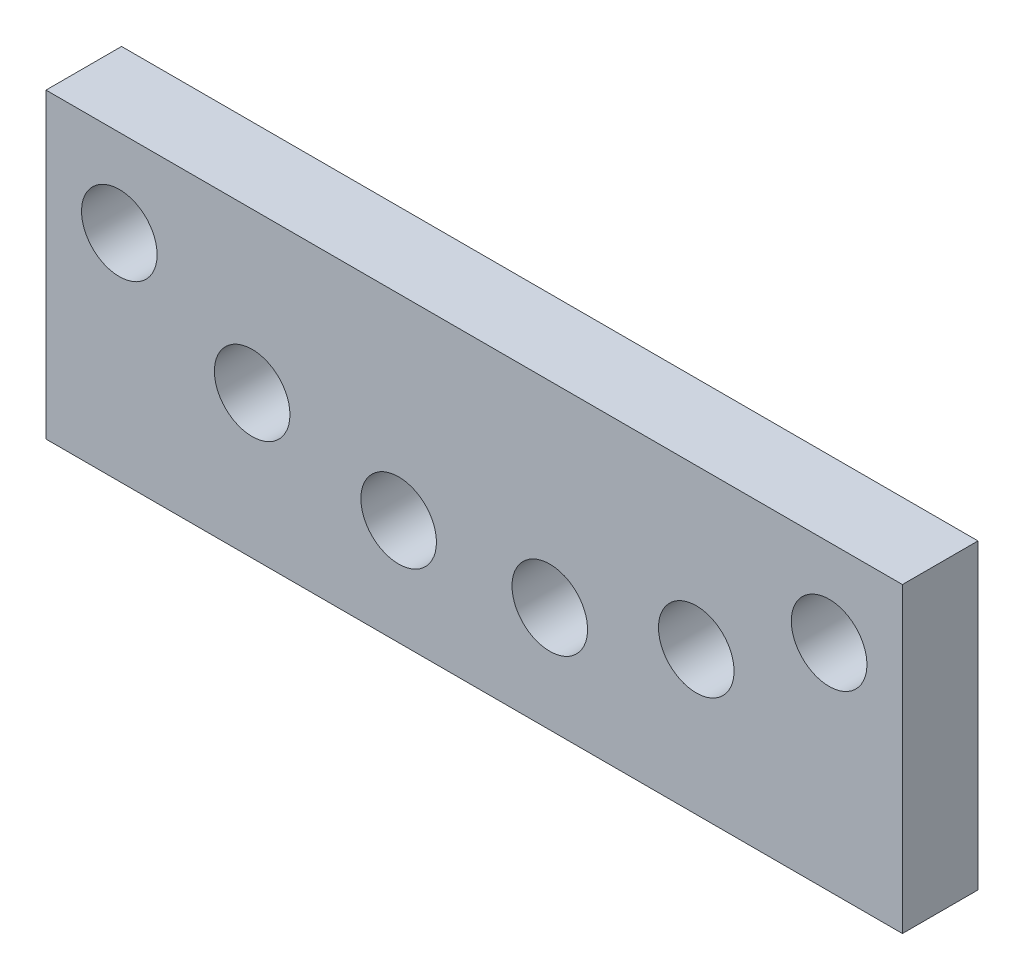
ISO-10303-21;
HEADER;
FILE_DESCRIPTION(('STEP AP214'),'2;1');
FILE_NAME('part.step','',(''),(''),'','','');
FILE_SCHEMA(('AUTOMOTIVE_DESIGN { 1 0 10303 214 1 1 1 1 }'));
ENDSEC;
DATA;
#1=APPLICATION_CONTEXT('core data for automotive mechanical design processes');
#2=APPLICATION_PROTOCOL_DEFINITION('international standard','automotive_design',2000,#1);
#3=PRODUCT_CONTEXT('',#1,'mechanical');
#4=PRODUCT('Part','Part','',(#3));
#5=PRODUCT_RELATED_PRODUCT_CATEGORY('part','',(#4));
#6=PRODUCT_DEFINITION_FORMATION('','',#4);
#7=PRODUCT_DEFINITION_CONTEXT('part definition',#1,'design');
#8=PRODUCT_DEFINITION('design','',#6,#7);
#9=PRODUCT_DEFINITION_SHAPE('','',#8);
#10=(LENGTH_UNIT() NAMED_UNIT(*) SI_UNIT(.MILLI.,.METRE.));
#11=(NAMED_UNIT(*) PLANE_ANGLE_UNIT() SI_UNIT($,.RADIAN.));
#12=(NAMED_UNIT(*) SI_UNIT($,.STERADIAN.) SOLID_ANGLE_UNIT());
#13=UNCERTAINTY_MEASURE_WITH_UNIT(LENGTH_MEASURE(1.E-05),#10,'distance_accuracy_value','');
#14=(GEOMETRIC_REPRESENTATION_CONTEXT(3) GLOBAL_UNCERTAINTY_ASSIGNED_CONTEXT((#13)) GLOBAL_UNIT_ASSIGNED_CONTEXT((#10,
#11,#12)) REPRESENTATION_CONTEXT('',''));
#15=CARTESIAN_POINT('',(0.,0.,0.));
#16=DIRECTION('',(0.,0.,1.));
#17=DIRECTION('',(1.,0.,0.));
#18=AXIS2_PLACEMENT_3D('',#15,#16,#17);
#19=CARTESIAN_POINT('',(85.,-30.,7.5));
#20=DIRECTION('',(0.,1.,0.));
#21=DIRECTION('',(0.,0.,1.));
#22=AXIS2_PLACEMENT_3D('',#19,#20,#21);
#23=PLANE('',#22);
#24=DIRECTION('',(0.,0.,-1.));
#25=VECTOR('',#24,1.);
#26=CARTESIAN_POINT('',(-85.,-30.,7.5));
#27=LINE('',#26,#25);
#28=CARTESIAN_POINT('',(-85.,-30.,7.5));
#29=VERTEX_POINT('',#28);
#30=CARTESIAN_POINT('',(-85.,-30.,-7.5));
#31=VERTEX_POINT('',#30);
#32=EDGE_CURVE('E111',#29,#31,#27,.T.);
#33=ORIENTED_EDGE('',*,*,#32,.T.);
#34=DIRECTION('',(-1.,0.,0.));
#35=VECTOR('',#34,1.);
#36=CARTESIAN_POINT('',(85.,-30.,-7.5));
#37=LINE('',#36,#35);
#38=CARTESIAN_POINT('',(85.,-30.,-7.5));
#39=VERTEX_POINT('',#38);
#40=EDGE_CURVE('E12',#39,#31,#37,.T.);
#41=ORIENTED_EDGE('',*,*,#40,.F.);
#42=DIRECTION('',(0.,0.,-1.));
#43=VECTOR('',#42,1.);
#44=CARTESIAN_POINT('',(85.,-30.,7.5));
#45=LINE('',#44,#43);
#46=CARTESIAN_POINT('',(85.,-30.,7.5));
#47=VERTEX_POINT('',#46);
#48=EDGE_CURVE('E99',#47,#39,#45,.T.);
#49=ORIENTED_EDGE('',*,*,#48,.F.);
#50=DIRECTION('',(-1.,0.,0.));
#51=VECTOR('',#50,1.);
#52=CARTESIAN_POINT('',(85.,-30.,7.5));
#53=LINE('',#52,#51);
#54=EDGE_CURVE('E107',#47,#29,#53,.T.);
#55=ORIENTED_EDGE('',*,*,#54,.T.);
#56=EDGE_LOOP('',(#33,#41,#49,#55));
#57=FACE_BOUND('',#56,.T.);
#58=ADVANCED_FACE('F48',(#57),#23,.F.);
#59=CARTESIAN_POINT('',(85.,-30.,-7.5));
#60=DIRECTION('',(0.,0.,1.));
#61=DIRECTION('',(1.,0.,0.));
#62=AXIS2_PLACEMENT_3D('',#59,#60,#61);
#63=PLANE('',#62);
#64=CARTESIAN_POINT('',(15.,-8.97969273634752,-7.5));
#65=DIRECTION('',(0.,0.,1.));
#66=DIRECTION('',(-1.,0.,0.));
#67=AXIS2_PLACEMENT_3D('',#64,#65,#66);
#68=CIRCLE('',#67,7.49999999999999);
#69=CARTESIAN_POINT('',(7.50000000000001,-8.97969273634752,-7.5));
#70=VERTEX_POINT('',#69);
#71=EDGE_CURVE('E152',#70,#70,#68,.T.);
#72=ORIENTED_EDGE('',*,*,#71,.T.);
#73=EDGE_LOOP('',(#72));
#74=FACE_BOUND('',#73,.T.);
#75=CARTESIAN_POINT('',(44.0779318352571,-1.59905047539634,-7.5));
#76=DIRECTION('',(0.,0.,1.));
#77=DIRECTION('',(-1.,0.,0.));
#78=AXIS2_PLACEMENT_3D('',#75,#76,#77);
#79=CIRCLE('',#78,7.5);
#80=CARTESIAN_POINT('',(36.5779318352571,-1.59905047539634,-7.5));
#81=VERTEX_POINT('',#80);
#82=EDGE_CURVE('E146',#81,#81,#79,.T.);
#83=ORIENTED_EDGE('',*,*,#82,.T.);
#84=EDGE_LOOP('',(#83));
#85=FACE_BOUND('',#84,.T.);
#86=CARTESIAN_POINT('',(-70.4463398229813,12.7085370288941,-7.5));
#87=DIRECTION('',(0.,0.,1.));
#88=DIRECTION('',(1.,0.,0.));
#89=AXIS2_PLACEMENT_3D('',#86,#87,#88);
#90=CIRCLE('',#89,7.5);
#91=CARTESIAN_POINT('',(-62.9463398229813,12.7085370288941,-7.5));
#92=VERTEX_POINT('',#91);
#93=EDGE_CURVE('E140',#92,#92,#90,.T.);
#94=ORIENTED_EDGE('',*,*,#93,.T.);
#95=EDGE_LOOP('',(#94));
#96=FACE_BOUND('',#95,.T.);
#97=CARTESIAN_POINT('',(-44.0779318352571,-1.59905047539634,-7.5));
#98=DIRECTION('',(0.,0.,1.));
#99=DIRECTION('',(1.,0.,0.));
#100=AXIS2_PLACEMENT_3D('',#97,#98,#99);
#101=CIRCLE('',#100,7.5);
#102=CARTESIAN_POINT('',(-36.5779318352571,-1.59905047539634,-7.5));
#103=VERTEX_POINT('',#102);
#104=EDGE_CURVE('E134',#103,#103,#101,.T.);
#105=ORIENTED_EDGE('',*,*,#104,.T.);
#106=EDGE_LOOP('',(#105));
#107=FACE_BOUND('',#106,.T.);
#108=CARTESIAN_POINT('',(-15.,-8.97969273634752,-7.5));
#109=DIRECTION('',(0.,0.,1.));
#110=DIRECTION('',(1.,0.,0.));
#111=AXIS2_PLACEMENT_3D('',#108,#109,#110);
#112=CIRCLE('',#111,7.5);
#113=CARTESIAN_POINT('',(-7.5,-8.97969273634752,-7.5));
#114=VERTEX_POINT('',#113);
#115=EDGE_CURVE('E128',#114,#114,#112,.T.);
#116=ORIENTED_EDGE('',*,*,#115,.T.);
#117=EDGE_LOOP('',(#116));
#118=FACE_BOUND('',#117,.T.);
#119=CARTESIAN_POINT('',(70.4463398229813,12.7085370288941,-7.5));
#120=DIRECTION('',(0.,0.,1.));
#121=DIRECTION('',(-1.,0.,0.));
#122=AXIS2_PLACEMENT_3D('',#119,#120,#121);
#123=CIRCLE('',#122,7.50000000000001);
#124=CARTESIAN_POINT('',(62.9463398229812,12.7085370288941,-7.5));
#125=VERTEX_POINT('',#124);
#126=EDGE_CURVE('E114',#125,#125,#123,.T.);
#127=ORIENTED_EDGE('',*,*,#126,.T.);
#128=EDGE_LOOP('',(#127));
#129=FACE_BOUND('',#128,.T.);
#130=DIRECTION('',(0.,1.,0.));
#131=VECTOR('',#130,1.);
#132=CARTESIAN_POINT('',(-85.,-30.,-7.5));
#133=LINE('',#132,#131);
#134=CARTESIAN_POINT('',(-85.,30.,-7.5));
#135=VERTEX_POINT('',#134);
#136=EDGE_CURVE('E103',#31,#135,#133,.T.);
#137=ORIENTED_EDGE('',*,*,#136,.T.);
#138=DIRECTION('',(-1.,0.,0.));
#139=VECTOR('',#138,1.);
#140=CARTESIAN_POINT('',(85.,30.,-7.5));
#141=LINE('',#140,#139);
#142=CARTESIAN_POINT('',(85.,30.,-7.5));
#143=VERTEX_POINT('',#142);
#144=EDGE_CURVE('E56',#143,#135,#141,.T.);
#145=ORIENTED_EDGE('',*,*,#144,.F.);
#146=DIRECTION('',(0.,1.,0.));
#147=VECTOR('',#146,1.);
#148=CARTESIAN_POINT('',(85.,-30.,-7.5));
#149=LINE('',#148,#147);
#150=EDGE_CURVE('E94',#39,#143,#149,.T.);
#151=ORIENTED_EDGE('',*,*,#150,.F.);
#152=ORIENTED_EDGE('',*,*,#40,.T.);
#153=EDGE_LOOP('',(#137,#145,#151,#152));
#154=FACE_BOUND('',#153,.T.);
#155=ADVANCED_FACE('F102',(#74,#85,#96,#107,#118,#129,#154),#63,.F.);
#156=CARTESIAN_POINT('',(85.,30.,7.5));
#157=DIRECTION('',(0.,-1.,0.));
#158=DIRECTION('',(0.,0.,-1.));
#159=AXIS2_PLACEMENT_3D('',#156,#157,#158);
#160=PLANE('',#159);
#161=DIRECTION('',(0.,0.,1.));
#162=VECTOR('',#161,1.);
#163=CARTESIAN_POINT('',(-85.,30.,7.5));
#164=LINE('',#163,#162);
#165=CARTESIAN_POINT('',(-85.,30.,7.5));
#166=VERTEX_POINT('',#165);
#167=EDGE_CURVE('E81',#135,#166,#164,.T.);
#168=ORIENTED_EDGE('',*,*,#167,.T.);
#169=DIRECTION('',(-1.,0.,0.));
#170=VECTOR('',#169,1.);
#171=CARTESIAN_POINT('',(85.,30.,7.5));
#172=LINE('',#171,#170);
#173=CARTESIAN_POINT('',(85.,30.,7.5));
#174=VERTEX_POINT('',#173);
#175=EDGE_CURVE('E104',#174,#166,#172,.T.);
#176=ORIENTED_EDGE('',*,*,#175,.F.);
#177=DIRECTION('',(0.,0.,1.));
#178=VECTOR('',#177,1.);
#179=CARTESIAN_POINT('',(85.,30.,7.5));
#180=LINE('',#179,#178);
#181=EDGE_CURVE('E97',#143,#174,#180,.T.);
#182=ORIENTED_EDGE('',*,*,#181,.F.);
#183=ORIENTED_EDGE('',*,*,#144,.T.);
#184=EDGE_LOOP('',(#168,#176,#182,#183));
#185=FACE_BOUND('',#184,.T.);
#186=ADVANCED_FACE('F105',(#185),#160,.F.);
#187=CARTESIAN_POINT('',(85.,-30.,7.5));
#188=DIRECTION('',(0.,0.,-1.));
#189=DIRECTION('',(-1.,0.,0.));
#190=AXIS2_PLACEMENT_3D('',#187,#188,#189);
#191=PLANE('',#190);
#192=CARTESIAN_POINT('',(15.,-8.97969273634752,7.5));
#193=DIRECTION('',(0.,0.,1.));
#194=DIRECTION('',(-1.,0.,0.));
#195=AXIS2_PLACEMENT_3D('',#192,#193,#194);
#196=CIRCLE('',#195,7.49999999999999);
#197=CARTESIAN_POINT('',(7.50000000000001,-8.97969273634752,7.5));
#198=VERTEX_POINT('',#197);
#199=EDGE_CURVE('E155',#198,#198,#196,.T.);
#200=ORIENTED_EDGE('',*,*,#199,.F.);
#201=EDGE_LOOP('',(#200));
#202=FACE_BOUND('',#201,.T.);
#203=CARTESIAN_POINT('',(44.0779318352571,-1.59905047539634,7.5));
#204=DIRECTION('',(0.,0.,1.));
#205=DIRECTION('',(-1.,0.,0.));
#206=AXIS2_PLACEMENT_3D('',#203,#204,#205);
#207=CIRCLE('',#206,7.5);
#208=CARTESIAN_POINT('',(36.5779318352571,-1.59905047539634,7.5));
#209=VERTEX_POINT('',#208);
#210=EDGE_CURVE('E149',#209,#209,#207,.T.);
#211=ORIENTED_EDGE('',*,*,#210,.F.);
#212=EDGE_LOOP('',(#211));
#213=FACE_BOUND('',#212,.T.);
#214=CARTESIAN_POINT('',(-70.4463398229813,12.7085370288941,7.5));
#215=DIRECTION('',(0.,0.,1.));
#216=DIRECTION('',(1.,0.,0.));
#217=AXIS2_PLACEMENT_3D('',#214,#215,#216);
#218=CIRCLE('',#217,7.5);
#219=CARTESIAN_POINT('',(-62.9463398229813,12.7085370288941,7.5));
#220=VERTEX_POINT('',#219);
#221=EDGE_CURVE('E143',#220,#220,#218,.T.);
#222=ORIENTED_EDGE('',*,*,#221,.F.);
#223=EDGE_LOOP('',(#222));
#224=FACE_BOUND('',#223,.T.);
#225=CARTESIAN_POINT('',(-44.0779318352571,-1.59905047539634,7.5));
#226=DIRECTION('',(0.,0.,1.));
#227=DIRECTION('',(1.,0.,0.));
#228=AXIS2_PLACEMENT_3D('',#225,#226,#227);
#229=CIRCLE('',#228,7.5);
#230=CARTESIAN_POINT('',(-36.5779318352571,-1.59905047539634,7.5));
#231=VERTEX_POINT('',#230);
#232=EDGE_CURVE('E137',#231,#231,#229,.T.);
#233=ORIENTED_EDGE('',*,*,#232,.F.);
#234=EDGE_LOOP('',(#233));
#235=FACE_BOUND('',#234,.T.);
#236=CARTESIAN_POINT('',(-15.,-8.97969273634752,7.5));
#237=DIRECTION('',(0.,0.,1.));
#238=DIRECTION('',(1.,0.,0.));
#239=AXIS2_PLACEMENT_3D('',#236,#237,#238);
#240=CIRCLE('',#239,7.5);
#241=CARTESIAN_POINT('',(-7.5,-8.97969273634752,7.5));
#242=VERTEX_POINT('',#241);
#243=EDGE_CURVE('E131',#242,#242,#240,.T.);
#244=ORIENTED_EDGE('',*,*,#243,.F.);
#245=EDGE_LOOP('',(#244));
#246=FACE_BOUND('',#245,.T.);
#247=CARTESIAN_POINT('',(70.4463398229813,12.7085370288941,7.5));
#248=DIRECTION('',(0.,0.,1.));
#249=DIRECTION('',(-1.,0.,0.));
#250=AXIS2_PLACEMENT_3D('',#247,#248,#249);
#251=CIRCLE('',#250,7.50000000000001);
#252=CARTESIAN_POINT('',(62.9463398229812,12.7085370288941,7.5));
#253=VERTEX_POINT('',#252);
#254=EDGE_CURVE('E125',#253,#253,#251,.T.);
#255=ORIENTED_EDGE('',*,*,#254,.F.);
#256=EDGE_LOOP('',(#255));
#257=FACE_BOUND('',#256,.T.);
#258=DIRECTION('',(0.,-1.,0.));
#259=VECTOR('',#258,1.);
#260=CARTESIAN_POINT('',(-85.,-30.,7.5));
#261=LINE('',#260,#259);
#262=EDGE_CURVE('E87',#166,#29,#261,.T.);
#263=ORIENTED_EDGE('',*,*,#262,.T.);
#264=ORIENTED_EDGE('',*,*,#54,.F.);
#265=DIRECTION('',(0.,-1.,0.));
#266=VECTOR('',#265,1.);
#267=CARTESIAN_POINT('',(85.,-30.,7.5));
#268=LINE('',#267,#266);
#269=EDGE_CURVE('E64',#174,#47,#268,.T.);
#270=ORIENTED_EDGE('',*,*,#269,.F.);
#271=ORIENTED_EDGE('',*,*,#175,.T.);
#272=EDGE_LOOP('',(#263,#264,#270,#271));
#273=FACE_BOUND('',#272,.T.);
#274=ADVANCED_FACE('F119',(#202,#213,#224,#235,#246,#257,#273),#191,.F.);
#275=CARTESIAN_POINT('',(85.,-30.,-7.5));
#276=DIRECTION('',(1.,0.,0.));
#277=DIRECTION('',(0.,0.,-1.));
#278=AXIS2_PLACEMENT_3D('',#275,#276,#277);
#279=PLANE('',#278);
#280=ORIENTED_EDGE('',*,*,#48,.T.);
#281=ORIENTED_EDGE('',*,*,#150,.T.);
#282=ORIENTED_EDGE('',*,*,#181,.T.);
#283=ORIENTED_EDGE('',*,*,#269,.T.);
#284=EDGE_LOOP('',(#280,#281,#282,#283));
#285=FACE_BOUND('',#284,.T.);
#286=ADVANCED_FACE('F95',(#285),#279,.T.);
#287=CARTESIAN_POINT('',(-85.,-30.,-7.5));
#288=DIRECTION('',(1.,0.,0.));
#289=DIRECTION('',(0.,0.,-1.));
#290=AXIS2_PLACEMENT_3D('',#287,#288,#289);
#291=PLANE('',#290);
#292=ORIENTED_EDGE('',*,*,#32,.F.);
#293=ORIENTED_EDGE('',*,*,#262,.F.);
#294=ORIENTED_EDGE('',*,*,#167,.F.);
#295=ORIENTED_EDGE('',*,*,#136,.F.);
#296=EDGE_LOOP('',(#292,#293,#294,#295));
#297=FACE_BOUND('',#296,.T.);
#298=ADVANCED_FACE('F122',(#297),#291,.F.);
#299=CARTESIAN_POINT('',(70.4463398229813,12.7085370288941,-7.5));
#300=DIRECTION('',(0.,0.,1.));
#301=DIRECTION('',(1.,0.,0.));
#302=AXIS2_PLACEMENT_3D('',#299,#300,#301);
#303=CYLINDRICAL_SURFACE('',#302,7.50000000000001);
#304=ORIENTED_EDGE('',*,*,#126,.F.);
#305=EDGE_LOOP('',(#304));
#306=FACE_BOUND('',#305,.T.);
#307=ORIENTED_EDGE('',*,*,#254,.T.);
#308=EDGE_LOOP('',(#307));
#309=FACE_BOUND('',#308,.T.);
#310=ADVANCED_FACE('F183',(#306,#309),#303,.F.);
#311=CARTESIAN_POINT('',(-15.,-8.97969273634752,-7.5));
#312=DIRECTION('',(0.,0.,1.));
#313=DIRECTION('',(1.,0.,0.));
#314=AXIS2_PLACEMENT_3D('',#311,#312,#313);
#315=CYLINDRICAL_SURFACE('',#314,7.5);
#316=ORIENTED_EDGE('',*,*,#115,.F.);
#317=EDGE_LOOP('',(#316));
#318=FACE_BOUND('',#317,.T.);
#319=ORIENTED_EDGE('',*,*,#243,.T.);
#320=EDGE_LOOP('',(#319));
#321=FACE_BOUND('',#320,.T.);
#322=ADVANCED_FACE('F185',(#318,#321),#315,.F.);
#323=CARTESIAN_POINT('',(-44.0779318352571,-1.59905047539634,-7.5));
#324=DIRECTION('',(0.,0.,1.));
#325=DIRECTION('',(1.,0.,0.));
#326=AXIS2_PLACEMENT_3D('',#323,#324,#325);
#327=CYLINDRICAL_SURFACE('',#326,7.5);
#328=ORIENTED_EDGE('',*,*,#104,.F.);
#329=EDGE_LOOP('',(#328));
#330=FACE_BOUND('',#329,.T.);
#331=ORIENTED_EDGE('',*,*,#232,.T.);
#332=EDGE_LOOP('',(#331));
#333=FACE_BOUND('',#332,.T.);
#334=ADVANCED_FACE('F192',(#330,#333),#327,.F.);
#335=CARTESIAN_POINT('',(-70.4463398229813,12.7085370288941,-7.5));
#336=DIRECTION('',(0.,0.,1.));
#337=DIRECTION('',(1.,0.,0.));
#338=AXIS2_PLACEMENT_3D('',#335,#336,#337);
#339=CYLINDRICAL_SURFACE('',#338,7.5);
#340=ORIENTED_EDGE('',*,*,#93,.F.);
#341=EDGE_LOOP('',(#340));
#342=FACE_BOUND('',#341,.T.);
#343=ORIENTED_EDGE('',*,*,#221,.T.);
#344=EDGE_LOOP('',(#343));
#345=FACE_BOUND('',#344,.T.);
#346=ADVANCED_FACE('F248',(#342,#345),#339,.F.);
#347=CARTESIAN_POINT('',(44.0779318352571,-1.59905047539634,-7.5));
#348=DIRECTION('',(0.,0.,1.));
#349=DIRECTION('',(1.,0.,0.));
#350=AXIS2_PLACEMENT_3D('',#347,#348,#349);
#351=CYLINDRICAL_SURFACE('',#350,7.5);
#352=ORIENTED_EDGE('',*,*,#82,.F.);
#353=EDGE_LOOP('',(#352));
#354=FACE_BOUND('',#353,.T.);
#355=ORIENTED_EDGE('',*,*,#210,.T.);
#356=EDGE_LOOP('',(#355));
#357=FACE_BOUND('',#356,.T.);
#358=ADVANCED_FACE('F166',(#354,#357),#351,.F.);
#359=CARTESIAN_POINT('',(15.,-8.97969273634752,-7.5));
#360=DIRECTION('',(0.,0.,1.));
#361=DIRECTION('',(1.,0.,0.));
#362=AXIS2_PLACEMENT_3D('',#359,#360,#361);
#363=CYLINDRICAL_SURFACE('',#362,7.49999999999999);
#364=ORIENTED_EDGE('',*,*,#71,.F.);
#365=EDGE_LOOP('',(#364));
#366=FACE_BOUND('',#365,.T.);
#367=ORIENTED_EDGE('',*,*,#199,.T.);
#368=EDGE_LOOP('',(#367));
#369=FACE_BOUND('',#368,.T.);
#370=ADVANCED_FACE('F163',(#366,#369),#363,.F.);
#371=CLOSED_SHELL('',(#58,#155,#186,#274,#286,#298,#310,#322,#334,#346,#358,#370));
#372=MANIFOLD_SOLID_BREP('B2',#371);
#373=ADVANCED_BREP_SHAPE_REPRESENTATION('',(#18,#372),#14);
#374=SHAPE_DEFINITION_REPRESENTATION(#9,#373);
ENDSEC;
END-ISO-10303-21;
